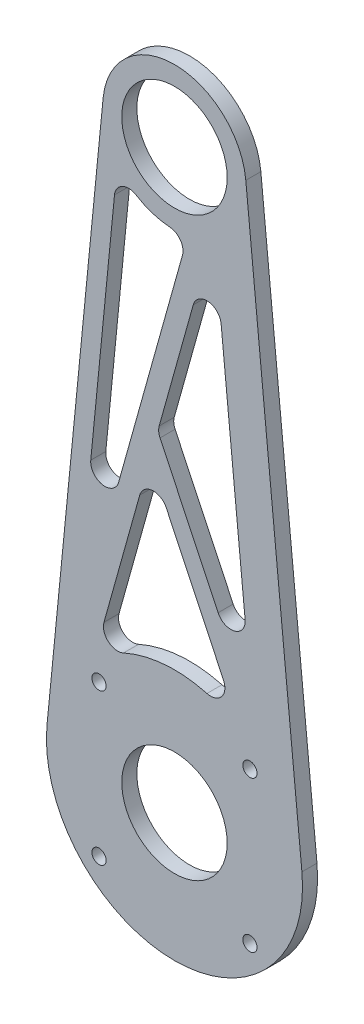
ISO-10303-21;
HEADER;
FILE_DESCRIPTION(('STEP AP214'),'2;1');
FILE_NAME('part.step','',(''),(''),'','','');
FILE_SCHEMA(('AUTOMOTIVE_DESIGN { 1 0 10303 214 1 1 1 1 }'));
ENDSEC;
DATA;
#1=APPLICATION_CONTEXT('core data for automotive mechanical design processes');
#2=APPLICATION_PROTOCOL_DEFINITION('international standard','automotive_design',2000,#1);
#3=PRODUCT_CONTEXT('',#1,'mechanical');
#4=PRODUCT('Part','Part','',(#3));
#5=PRODUCT_RELATED_PRODUCT_CATEGORY('part','',(#4));
#6=PRODUCT_DEFINITION_FORMATION('','',#4);
#7=PRODUCT_DEFINITION_CONTEXT('part definition',#1,'design');
#8=PRODUCT_DEFINITION('design','',#6,#7);
#9=PRODUCT_DEFINITION_SHAPE('','',#8);
#10=(LENGTH_UNIT() NAMED_UNIT(*) SI_UNIT(.MILLI.,.METRE.));
#11=(NAMED_UNIT(*) PLANE_ANGLE_UNIT() SI_UNIT($,.RADIAN.));
#12=(NAMED_UNIT(*) SI_UNIT($,.STERADIAN.) SOLID_ANGLE_UNIT());
#13=UNCERTAINTY_MEASURE_WITH_UNIT(LENGTH_MEASURE(1.E-05),#10,'distance_accuracy_value','');
#14=(GEOMETRIC_REPRESENTATION_CONTEXT(3) GLOBAL_UNCERTAINTY_ASSIGNED_CONTEXT((#13)) GLOBAL_UNIT_ASSIGNED_CONTEXT((#10,
#11,#12)) REPRESENTATION_CONTEXT('',''));
#15=CARTESIAN_POINT('',(0.,0.,0.));
#16=DIRECTION('',(0.,0.,1.));
#17=DIRECTION('',(1.,0.,0.));
#18=AXIS2_PLACEMENT_3D('',#15,#16,#17);
#19=CARTESIAN_POINT('',(0.,0.,3.175));
#20=DIRECTION('',(0.,0.,1.));
#21=DIRECTION('',(1.,0.,0.));
#22=AXIS2_PLACEMENT_3D('',#19,#20,#21);
#23=PLANE('',#22);
#24=DIRECTION('',(-0.428735457416867,0.903430078951078,0.));
#25=VECTOR('',#24,1.);
#26=CARTESIAN_POINT('',(-2.53849015341007,65.8517048939663,3.175));
#27=LINE('',#26,#25);
#28=CARTESIAN_POINT('',(9.1986159595942,41.1193098496756,3.175));
#29=VERTEX_POINT('',#28);
#30=CARTESIAN_POINT('',(-3.04408525005505,66.9170933757851,3.175));
#31=VERTEX_POINT('',#30);
#32=EDGE_CURVE('E425',#29,#31,#27,.T.);
#33=ORIENTED_EDGE('',*,*,#32,.T.);
#34=CARTESIAN_POINT('',(-0.333795013201807,68.2032997480357,3.175));
#35=DIRECTION('',(0.,0.,1.));
#36=DIRECTION('',(1.,0.,0.));
#37=AXIS2_PLACEMENT_3D('',#34,#35,#36);
#38=CIRCLE('',#37,3.);
#39=CARTESIAN_POINT('',(-3.22312817275436,69.0106125084391,3.175));
#40=VERTEX_POINT('',#39);
#41=EDGE_CURVE('E355',#31,#40,#38,.F.);
#42=ORIENTED_EDGE('',*,*,#41,.T.);
#43=DIRECTION('',(0.269104253467781,0.963111053184184,0.));
#44=VECTOR('',#43,1.);
#45=CARTESIAN_POINT('',(-3.52495645481792,67.930383746266,3.175));
#46=LINE('',#45,#44);
#47=CARTESIAN_POINT('',(3.95768063214824,94.7103784604181,3.175));
#48=VERTEX_POINT('',#47);
#49=EDGE_CURVE('E617',#40,#48,#46,.T.);
#50=ORIENTED_EDGE('',*,*,#49,.T.);
#51=CARTESIAN_POINT('',(6.84701379170079,93.9030657000147,3.175));
#52=DIRECTION('',(0.,0.,1.));
#53=DIRECTION('',(1.,0.,0.));
#54=AXIS2_PLACEMENT_3D('',#51,#52,#53);
#55=CIRCLE('',#54,3.);
#56=CARTESIAN_POINT('',(9.83262544841795,94.1965329644152,3.175));
#57=VERTEX_POINT('',#56);
#58=EDGE_CURVE('E343',#48,#57,#55,.F.);
#59=ORIENTED_EDGE('',*,*,#58,.T.);
#60=DIRECTION('',(0.0978224214668025,-0.995203885572384,0.));
#61=VECTOR('',#60,1.);
#62=CARTESIAN_POINT('',(8.26636884411464,110.130964304729,3.175));
#63=LINE('',#62,#61);
#64=CARTESIAN_POINT('',(14.8945178531645,42.6989834863266,3.175));
#65=VERTEX_POINT('',#64);
#66=EDGE_CURVE('E602',#57,#65,#63,.T.);
#67=ORIENTED_EDGE('',*,*,#66,.T.);
#68=CARTESIAN_POINT('',(11.9089061964473,42.4055162219262,3.175));
#69=DIRECTION('',(0.,0.,1.));
#70=DIRECTION('',(1.,0.,0.));
#71=AXIS2_PLACEMENT_3D('',#68,#69,#70);
#72=CIRCLE('',#71,3.);
#73=EDGE_CURVE('E349',#65,#29,#72,.F.);
#74=ORIENTED_EDGE('',*,*,#73,.T.);
#75=EDGE_LOOP('',(#33,#42,#50,#59,#67,#74));
#76=FACE_BOUND('',#75,.T.);
#77=CARTESIAN_POINT('',(0.,121.52122,3.175));
#78=DIRECTION('',(0.,0.,1.));
#79=DIRECTION('',(1.,0.,0.));
#80=AXIS2_PLACEMENT_3D('',#77,#78,#79);
#81=CIRCLE('',#80,11.1125);
#82=CARTESIAN_POINT('',(11.1125,121.52122,3.175));
#83=VERTEX_POINT('',#82);
#84=EDGE_CURVE('E229',#83,#83,#81,.T.);
#85=ORIENTED_EDGE('',*,*,#84,.F.);
#86=EDGE_LOOP('',(#85));
#87=FACE_BOUND('',#86,.T.);
#88=CARTESIAN_POINT('',(0.,0.,3.175));
#89=DIRECTION('',(0.,0.,1.));
#90=DIRECTION('',(1.,0.,0.));
#91=AXIS2_PLACEMENT_3D('',#88,#89,#90);
#92=CIRCLE('',#91,27.);
#93=CARTESIAN_POINT('',(-26.8705049104544,2.64120537960366,3.175));
#94=VERTEX_POINT('',#93);
#95=CARTESIAN_POINT('',(26.8705049104544,2.64120537960366,3.175));
#96=VERTEX_POINT('',#95);
#97=EDGE_CURVE('E193',#94,#96,#92,.T.);
#98=ORIENTED_EDGE('',*,*,#97,.T.);
#99=DIRECTION('',(0.0978224214668023,-0.995203885572384,0.));
#100=VECTOR('',#99,1.);
#101=CARTESIAN_POINT('',(26.8705049104544,2.64120537960366,3.175));
#102=LINE('',#101,#100);
#103=CARTESIAN_POINT('',(15.0400187207127,122.999561344417,3.175));
#104=VERTEX_POINT('',#103);
#105=EDGE_CURVE('E197',#104,#96,#102,.T.);
#106=ORIENTED_EDGE('',*,*,#105,.F.);
#107=CARTESIAN_POINT('',(0.,121.52122,3.175));
#108=DIRECTION('',(0.,0.,1.));
#109=DIRECTION('',(1.,0.,0.));
#110=AXIS2_PLACEMENT_3D('',#107,#108,#109);
#111=CIRCLE('',#110,15.1125);
#112=CARTESIAN_POINT('',(-15.0400187207127,122.999561344417,3.175));
#113=VERTEX_POINT('',#112);
#114=EDGE_CURVE('E221',#104,#113,#111,.T.);
#115=ORIENTED_EDGE('',*,*,#114,.T.);
#116=DIRECTION('',(-0.0978224214668023,-0.995203885572384,0.));
#117=VECTOR('',#116,1.);
#118=CARTESIAN_POINT('',(-26.8705049104544,2.64120537960366,3.175));
#119=LINE('',#118,#117);
#120=EDGE_CURVE('E199',#113,#94,#119,.T.);
#121=ORIENTED_EDGE('',*,*,#120,.T.);
#122=EDGE_LOOP('',(#98,#106,#115,#121));
#123=FACE_BOUND('',#122,.T.);
#124=CARTESIAN_POINT('',(-15.9099025766974,15.9099025766964,3.175));
#125=DIRECTION('',(0.,0.,1.));
#126=DIRECTION('',(1.,0.,0.));
#127=AXIS2_PLACEMENT_3D('',#124,#125,#126);
#128=CIRCLE('',#127,1.50000000000096);
#129=CARTESIAN_POINT('',(-14.4099025766964,15.9099025766964,3.175));
#130=VERTEX_POINT('',#129);
#131=EDGE_CURVE('E204',#130,#130,#128,.T.);
#132=ORIENTED_EDGE('',*,*,#131,.F.);
#133=EDGE_LOOP('',(#132));
#134=FACE_BOUND('',#133,.T.);
#135=CARTESIAN_POINT('',(-15.9099025766964,-15.9099025766982,3.175));
#136=DIRECTION('',(0.,0.,1.));
#137=DIRECTION('',(1.,0.,0.));
#138=AXIS2_PLACEMENT_3D('',#135,#136,#137);
#139=CIRCLE('',#138,1.50000000000066);
#140=CARTESIAN_POINT('',(-14.4099025766957,-15.9099025766982,3.175));
#141=VERTEX_POINT('',#140);
#142=EDGE_CURVE('E462',#141,#141,#139,.T.);
#143=ORIENTED_EDGE('',*,*,#142,.F.);
#144=EDGE_LOOP('',(#143));
#145=FACE_BOUND('',#144,.T.);
#146=CARTESIAN_POINT('',(15.9099025766982,-15.9099025766973,3.175));
#147=DIRECTION('',(0.,0.,1.));
#148=DIRECTION('',(1.,0.,0.));
#149=AXIS2_PLACEMENT_3D('',#146,#147,#148);
#150=CIRCLE('',#149,1.49999999999978);
#151=CARTESIAN_POINT('',(17.409902576698,-15.9099025766973,3.175));
#152=VERTEX_POINT('',#151);
#153=EDGE_CURVE('E458',#152,#152,#150,.T.);
#154=ORIENTED_EDGE('',*,*,#153,.F.);
#155=EDGE_LOOP('',(#154));
#156=FACE_BOUND('',#155,.T.);
#157=CARTESIAN_POINT('',(15.9099025766973,15.9099025766974,3.175));
#158=DIRECTION('',(0.,0.,1.));
#159=DIRECTION('',(1.,0.,0.));
#160=AXIS2_PLACEMENT_3D('',#157,#158,#159);
#161=CIRCLE('',#160,1.5);
#162=CARTESIAN_POINT('',(17.4099025766973,15.9099025766974,3.175));
#163=VERTEX_POINT('',#162);
#164=EDGE_CURVE('E454',#163,#163,#161,.T.);
#165=ORIENTED_EDGE('',*,*,#164,.F.);
#166=EDGE_LOOP('',(#165));
#167=FACE_BOUND('',#166,.T.);
#168=CARTESIAN_POINT('',(0.,0.,3.175));
#169=DIRECTION('',(0.,0.,1.));
#170=DIRECTION('',(1.,0.,0.));
#171=AXIS2_PLACEMENT_3D('',#168,#169,#170);
#172=CIRCLE('',#171,11.1125);
#173=CARTESIAN_POINT('',(11.1125,0.,3.175));
#174=VERTEX_POINT('',#173);
#175=EDGE_CURVE('E270',#174,#174,#172,.T.);
#176=ORIENTED_EDGE('',*,*,#175,.F.);
#177=EDGE_LOOP('',(#176));
#178=FACE_BOUND('',#177,.T.);
#179=DIRECTION('',(0.269104253467781,0.963111053184184,0.));
#180=VECTOR('',#179,1.);
#181=CARTESIAN_POINT('',(-16.957069466739,19.8575036535358,3.175));
#182=LINE('',#181,#180);
#183=CARTESIAN_POINT('',(-14.8657438144377,27.3422565906728,3.175));
#184=VERTEX_POINT('',#183);
#185=CARTESIAN_POINT('',(-7.32509745522579,54.3298636727718,3.175));
#186=VERTEX_POINT('',#185);
#187=EDGE_CURVE('E239',#184,#186,#182,.T.);
#188=ORIENTED_EDGE('',*,*,#187,.T.);
#189=CARTESIAN_POINT('',(-4.43576429567324,53.5225509123685,3.175));
#190=DIRECTION('',(0.,0.,1.));
#191=DIRECTION('',(1.,0.,0.));
#192=AXIS2_PLACEMENT_3D('',#189,#190,#191);
#193=CIRCLE('',#192,3.);
#194=CARTESIAN_POINT('',(-1.72547405882001,54.8087572846191,3.175));
#195=VERTEX_POINT('',#194);
#196=EDGE_CURVE('E361',#186,#195,#193,.F.);
#197=ORIENTED_EDGE('',*,*,#196,.T.);
#198=DIRECTION('',(0.428735457416867,-0.903430078951078,0.));
#199=VECTOR('',#198,1.);
#200=CARTESIAN_POINT('',(-5.16574416780649,62.0580842119991,3.175));
#201=LINE('',#200,#199);
#202=CARTESIAN_POINT('',(10.3417913804946,29.3806514912523,3.175));
#203=VERTEX_POINT('',#202);
#204=EDGE_CURVE('E429',#195,#203,#201,.T.);
#205=ORIENTED_EDGE('',*,*,#204,.T.);
#206=CARTESIAN_POINT('',(7.63150114364133,28.0944451190017,3.175));
#207=DIRECTION('',(0.,0.,1.));
#208=DIRECTION('',(1.,0.,0.));
#209=AXIS2_PLACEMENT_3D('',#206,#207,#208);
#210=CIRCLE('',#209,3.);
#211=CARTESIAN_POINT('',(6.84508625550311,25.1993541664211,3.175));
#212=VERTEX_POINT('',#211);
#213=EDGE_CURVE('E367',#203,#212,#210,.F.);
#214=ORIENTED_EDGE('',*,*,#213,.T.);
#215=CARTESIAN_POINT('',(0.,0.,3.175));
#216=DIRECTION('',(0.,0.,1.));
#217=DIRECTION('',(-1.,0.,0.));
#218=AXIS2_PLACEMENT_3D('',#215,#216,#217);
#219=CIRCLE('',#218,26.1125);
#220=CARTESIAN_POINT('',(-10.7422592778253,23.8005571753683,3.175));
#221=VERTEX_POINT('',#220);
#222=EDGE_CURVE('E433',#212,#221,#219,.T.);
#223=ORIENTED_EDGE('',*,*,#222,.T.);
#224=CARTESIAN_POINT('',(-11.9764106548852,26.5349438302694,3.175));
#225=DIRECTION('',(0.,0.,1.));
#226=DIRECTION('',(1.,0.,0.));
#227=AXIS2_PLACEMENT_3D('',#224,#225,#226);
#228=CIRCLE('',#227,3.);
#229=EDGE_CURVE('E373',#221,#184,#228,.F.);
#230=ORIENTED_EDGE('',*,*,#229,.T.);
#231=EDGE_LOOP('',(#188,#197,#205,#214,#223,#230));
#232=FACE_BOUND('',#231,.T.);
#233=DIRECTION('',(0.0978224214668021,0.995203885572384,0.));
#234=VECTOR('',#233,1.);
#235=CARTESIAN_POINT('',(-21.005906622655,21.4147235138115,3.175));
#236=LINE('',#235,#234);
#237=CARTESIAN_POINT('',(-17.6506101431775,55.5500888375636,3.175));
#238=VERTEX_POINT('',#237);
#239=CARTESIAN_POINT('',(-12.6433526523182,106.491805841121,3.175));
#240=VERTEX_POINT('',#239);
#241=EDGE_CURVE('E414',#238,#240,#236,.T.);
#242=ORIENTED_EDGE('',*,*,#241,.T.);
#243=CARTESIAN_POINT('',(-9.65774099560108,106.19833857672,3.175));
#244=DIRECTION('',(0.,0.,1.));
#245=DIRECTION('',(1.,0.,0.));
#246=AXIS2_PLACEMENT_3D('',#243,#244,#245);
#247=CIRCLE('',#246,3.);
#248=CARTESIAN_POINT('',(-8.05811515782036,108.736289951177,3.175));
#249=VERTEX_POINT('',#248);
#250=EDGE_CURVE('E11',#240,#249,#247,.F.);
#251=ORIENTED_EDGE('',*,*,#250,.T.);
#252=CARTESIAN_POINT('',(0.,121.52122,3.175));
#253=DIRECTION('',(0.,0.,1.));
#254=DIRECTION('',(-1.,0.,0.));
#255=AXIS2_PLACEMENT_3D('',#252,#253,#254);
#256=CIRCLE('',#255,15.1125);
#257=CARTESIAN_POINT('',(-1.00094054364259,106.441903892229,3.175));
#258=VERTEX_POINT('',#257);
#259=EDGE_CURVE('E404',#249,#258,#256,.T.);
#260=ORIENTED_EDGE('',*,*,#259,.T.);
#261=CARTESIAN_POINT('',(-1.1996384183111,103.448491265376,3.175));
#262=DIRECTION('',(0.,0.,1.));
#263=DIRECTION('',(1.,0.,0.));
#264=AXIS2_PLACEMENT_3D('',#261,#262,#263);
#265=CIRCLE('',#264,3.);
#266=CARTESIAN_POINT('',(1.68969474124145,102.641178504972,3.175));
#267=VERTEX_POINT('',#266);
#268=EDGE_CURVE('E385',#258,#267,#265,.F.);
#269=ORIENTED_EDGE('',*,*,#268,.T.);
#270=DIRECTION('',(-0.269104253467781,-0.963111053184184,0.));
#271=VECTOR('',#270,1.);
#272=CARTESIAN_POINT('',(-21.005906622655,21.4147235138115,3.175));
#273=LINE('',#272,#271);
#274=CARTESIAN_POINT('',(-11.7756653269078,54.4493088127599,3.175));
#275=VERTEX_POINT('',#274);
#276=EDGE_CURVE('E410',#267,#275,#273,.T.);
#277=ORIENTED_EDGE('',*,*,#276,.T.);
#278=CARTESIAN_POINT('',(-14.6649984864603,55.2566215731632,3.175));
#279=DIRECTION('',(0.,0.,1.));
#280=DIRECTION('',(1.,0.,0.));
#281=AXIS2_PLACEMENT_3D('',#278,#279,#280);
#282=CIRCLE('',#281,3.);
#283=EDGE_CURVE('E379',#275,#238,#282,.F.);
#284=ORIENTED_EDGE('',*,*,#283,.T.);
#285=EDGE_LOOP('',(#242,#251,#260,#269,#277,#284));
#286=FACE_BOUND('',#285,.T.);
#287=ADVANCED_FACE('F43',(#76,#87,#123,#134,#145,#156,#167,#178,#232,#286),#23,.T.);
#288=CARTESIAN_POINT('',(0.,0.,0.));
#289=DIRECTION('',(0.,0.,1.));
#290=DIRECTION('',(1.,0.,0.));
#291=AXIS2_PLACEMENT_3D('',#288,#289,#290);
#292=PLANE('',#291);
#293=CARTESIAN_POINT('',(0.,0.,0.));
#294=DIRECTION('',(0.,0.,1.));
#295=DIRECTION('',(1.,0.,0.));
#296=AXIS2_PLACEMENT_3D('',#293,#294,#295);
#297=CIRCLE('',#296,11.1125);
#298=CARTESIAN_POINT('',(11.1125,0.,0.));
#299=VERTEX_POINT('',#298);
#300=EDGE_CURVE('E234',#299,#299,#297,.T.);
#301=ORIENTED_EDGE('',*,*,#300,.T.);
#302=EDGE_LOOP('',(#301));
#303=FACE_BOUND('',#302,.T.);
#304=CARTESIAN_POINT('',(15.9099025766973,15.9099025766974,0.));
#305=DIRECTION('',(0.,0.,1.));
#306=DIRECTION('',(1.,0.,0.));
#307=AXIS2_PLACEMENT_3D('',#304,#305,#306);
#308=CIRCLE('',#307,1.5);
#309=CARTESIAN_POINT('',(17.4099025766973,15.9099025766974,0.));
#310=VERTEX_POINT('',#309);
#311=EDGE_CURVE('E238',#310,#310,#308,.T.);
#312=ORIENTED_EDGE('',*,*,#311,.T.);
#313=EDGE_LOOP('',(#312));
#314=FACE_BOUND('',#313,.T.);
#315=CARTESIAN_POINT('',(15.9099025766982,-15.9099025766973,0.));
#316=DIRECTION('',(0.,0.,1.));
#317=DIRECTION('',(1.,0.,0.));
#318=AXIS2_PLACEMENT_3D('',#315,#316,#317);
#319=CIRCLE('',#318,1.49999999999978);
#320=CARTESIAN_POINT('',(17.409902576698,-15.9099025766973,0.));
#321=VERTEX_POINT('',#320);
#322=EDGE_CURVE('E243',#321,#321,#319,.T.);
#323=ORIENTED_EDGE('',*,*,#322,.T.);
#324=EDGE_LOOP('',(#323));
#325=FACE_BOUND('',#324,.T.);
#326=CARTESIAN_POINT('',(-15.9099025766964,-15.9099025766982,0.));
#327=DIRECTION('',(0.,0.,1.));
#328=DIRECTION('',(1.,0.,0.));
#329=AXIS2_PLACEMENT_3D('',#326,#327,#328);
#330=CIRCLE('',#329,1.50000000000066);
#331=CARTESIAN_POINT('',(-14.4099025766957,-15.9099025766982,0.));
#332=VERTEX_POINT('',#331);
#333=EDGE_CURVE('E247',#332,#332,#330,.T.);
#334=ORIENTED_EDGE('',*,*,#333,.T.);
#335=EDGE_LOOP('',(#334));
#336=FACE_BOUND('',#335,.T.);
#337=CARTESIAN_POINT('',(-15.9099025766974,15.9099025766964,0.));
#338=DIRECTION('',(0.,0.,1.));
#339=DIRECTION('',(1.,0.,0.));
#340=AXIS2_PLACEMENT_3D('',#337,#338,#339);
#341=CIRCLE('',#340,1.50000000000096);
#342=CARTESIAN_POINT('',(-14.4099025766964,15.9099025766964,0.));
#343=VERTEX_POINT('',#342);
#344=EDGE_CURVE('E251',#343,#343,#341,.T.);
#345=ORIENTED_EDGE('',*,*,#344,.T.);
#346=EDGE_LOOP('',(#345));
#347=FACE_BOUND('',#346,.T.);
#348=CARTESIAN_POINT('',(0.,0.,0.));
#349=DIRECTION('',(0.,0.,1.));
#350=DIRECTION('',(1.,0.,0.));
#351=AXIS2_PLACEMENT_3D('',#348,#349,#350);
#352=CIRCLE('',#351,27.);
#353=CARTESIAN_POINT('',(-26.8705049104544,2.64120537960366,0.));
#354=VERTEX_POINT('',#353);
#355=CARTESIAN_POINT('',(26.8705049104544,2.64120537960366,0.));
#356=VERTEX_POINT('',#355);
#357=EDGE_CURVE('E210',#354,#356,#352,.T.);
#358=ORIENTED_EDGE('',*,*,#357,.F.);
#359=DIRECTION('',(-0.0978224214668023,-0.995203885572384,0.));
#360=VECTOR('',#359,1.);
#361=CARTESIAN_POINT('',(-26.8705049104544,2.64120537960366,0.));
#362=LINE('',#361,#360);
#363=CARTESIAN_POINT('',(-15.0400187207127,122.999561344417,0.));
#364=VERTEX_POINT('',#363);
#365=EDGE_CURVE('E263',#364,#354,#362,.T.);
#366=ORIENTED_EDGE('',*,*,#365,.F.);
#367=CARTESIAN_POINT('',(0.,121.52122,0.));
#368=DIRECTION('',(0.,0.,1.));
#369=DIRECTION('',(1.,0.,0.));
#370=AXIS2_PLACEMENT_3D('',#367,#368,#369);
#371=CIRCLE('',#370,15.1125);
#372=CARTESIAN_POINT('',(15.0400187207127,122.999561344417,0.));
#373=VERTEX_POINT('',#372);
#374=EDGE_CURVE('E260',#373,#364,#371,.T.);
#375=ORIENTED_EDGE('',*,*,#374,.F.);
#376=DIRECTION('',(0.0978224214668023,-0.995203885572384,0.));
#377=VECTOR('',#376,1.);
#378=CARTESIAN_POINT('',(26.8705049104544,2.64120537960366,0.));
#379=LINE('',#378,#377);
#380=EDGE_CURVE('E257',#373,#356,#379,.T.);
#381=ORIENTED_EDGE('',*,*,#380,.T.);
#382=EDGE_LOOP('',(#358,#366,#375,#381));
#383=FACE_BOUND('',#382,.T.);
#384=CARTESIAN_POINT('',(0.,121.52122,0.));
#385=DIRECTION('',(0.,0.,1.));
#386=DIRECTION('',(1.,0.,0.));
#387=AXIS2_PLACEMENT_3D('',#384,#385,#386);
#388=CIRCLE('',#387,11.1125);
#389=CARTESIAN_POINT('',(11.1125,121.52122,0.));
#390=VERTEX_POINT('',#389);
#391=EDGE_CURVE('E266',#390,#390,#388,.T.);
#392=ORIENTED_EDGE('',*,*,#391,.T.);
#393=EDGE_LOOP('',(#392));
#394=FACE_BOUND('',#393,.T.);
#395=CARTESIAN_POINT('',(0.,0.,0.));
#396=DIRECTION('',(0.,0.,1.));
#397=DIRECTION('',(-1.,0.,0.));
#398=AXIS2_PLACEMENT_3D('',#395,#396,#397);
#399=CIRCLE('',#398,26.1125);
#400=CARTESIAN_POINT('',(6.84508625550311,25.1993541664211,0.));
#401=VERTEX_POINT('',#400);
#402=CARTESIAN_POINT('',(-10.7422592778253,23.8005571753683,0.));
#403=VERTEX_POINT('',#402);
#404=EDGE_CURVE('E444',#401,#403,#399,.T.);
#405=ORIENTED_EDGE('',*,*,#404,.F.);
#406=CARTESIAN_POINT('',(7.63150114364133,28.0944451190017,0.));
#407=DIRECTION('',(0.,0.,1.));
#408=DIRECTION('',(1.,0.,0.));
#409=AXIS2_PLACEMENT_3D('',#406,#407,#408);
#410=CIRCLE('',#409,3.);
#411=CARTESIAN_POINT('',(10.3417913804946,29.3806514912523,0.));
#412=VERTEX_POINT('',#411);
#413=EDGE_CURVE('E364',#401,#412,#410,.T.);
#414=ORIENTED_EDGE('',*,*,#413,.T.);
#415=DIRECTION('',(0.428735457416867,-0.903430078951078,0.));
#416=VECTOR('',#415,1.);
#417=CARTESIAN_POINT('',(-5.16574416780649,62.0580842119991,0.));
#418=LINE('',#417,#416);
#419=CARTESIAN_POINT('',(-1.72547405882001,54.8087572846191,0.));
#420=VERTEX_POINT('',#419);
#421=EDGE_CURVE('E422',#420,#412,#418,.T.);
#422=ORIENTED_EDGE('',*,*,#421,.F.);
#423=CARTESIAN_POINT('',(-4.43576429567324,53.5225509123685,0.));
#424=DIRECTION('',(0.,0.,1.));
#425=DIRECTION('',(1.,0.,0.));
#426=AXIS2_PLACEMENT_3D('',#423,#424,#425);
#427=CIRCLE('',#426,3.);
#428=CARTESIAN_POINT('',(-7.32509745522579,54.3298636727718,0.));
#429=VERTEX_POINT('',#428);
#430=EDGE_CURVE('E358',#420,#429,#427,.T.);
#431=ORIENTED_EDGE('',*,*,#430,.T.);
#432=DIRECTION('',(0.269104253467781,0.963111053184184,0.));
#433=VECTOR('',#432,1.);
#434=CARTESIAN_POINT('',(-16.957069466739,19.8575036535358,0.));
#435=LINE('',#434,#433);
#436=CARTESIAN_POINT('',(-14.8657438144377,27.3422565906728,0.));
#437=VERTEX_POINT('',#436);
#438=EDGE_CURVE('E434',#437,#429,#435,.T.);
#439=ORIENTED_EDGE('',*,*,#438,.F.);
#440=CARTESIAN_POINT('',(-11.9764106548852,26.5349438302694,0.));
#441=DIRECTION('',(0.,0.,1.));
#442=DIRECTION('',(1.,0.,0.));
#443=AXIS2_PLACEMENT_3D('',#440,#441,#442);
#444=CIRCLE('',#443,3.);
#445=EDGE_CURVE('E370',#437,#403,#444,.T.);
#446=ORIENTED_EDGE('',*,*,#445,.T.);
#447=EDGE_LOOP('',(#405,#414,#422,#431,#439,#446));
#448=FACE_BOUND('',#447,.T.);
#449=DIRECTION('',(0.0978224214668025,-0.995203885572384,0.));
#450=VECTOR('',#449,1.);
#451=CARTESIAN_POINT('',(8.26636884411464,110.130964304729,0.));
#452=LINE('',#451,#450);
#453=CARTESIAN_POINT('',(9.83262544841795,94.1965329644152,0.));
#454=VERTEX_POINT('',#453);
#455=CARTESIAN_POINT('',(14.8945178531645,42.6989834863266,0.));
#456=VERTEX_POINT('',#455);
#457=EDGE_CURVE('E609',#454,#456,#452,.T.);
#458=ORIENTED_EDGE('',*,*,#457,.F.);
#459=CARTESIAN_POINT('',(6.84701379170079,93.9030657000147,0.));
#460=DIRECTION('',(0.,0.,1.));
#461=DIRECTION('',(1.,0.,0.));
#462=AXIS2_PLACEMENT_3D('',#459,#460,#461);
#463=CIRCLE('',#462,3.);
#464=CARTESIAN_POINT('',(3.95768063214824,94.7103784604181,0.));
#465=VERTEX_POINT('',#464);
#466=EDGE_CURVE('E340',#454,#465,#463,.T.);
#467=ORIENTED_EDGE('',*,*,#466,.T.);
#468=DIRECTION('',(0.269104253467781,0.963111053184184,0.));
#469=VECTOR('',#468,1.);
#470=CARTESIAN_POINT('',(-3.52495645481792,67.930383746266,0.));
#471=LINE('',#470,#469);
#472=CARTESIAN_POINT('',(-3.22312817275436,69.0106125084391,0.));
#473=VERTEX_POINT('',#472);
#474=EDGE_CURVE('E614',#473,#465,#471,.T.);
#475=ORIENTED_EDGE('',*,*,#474,.F.);
#476=CARTESIAN_POINT('',(-0.333795013201807,68.2032997480357,0.));
#477=DIRECTION('',(0.,0.,1.));
#478=DIRECTION('',(1.,0.,0.));
#479=AXIS2_PLACEMENT_3D('',#476,#477,#478);
#480=CIRCLE('',#479,3.);
#481=CARTESIAN_POINT('',(-3.04408525005504,66.9170933757851,0.));
#482=VERTEX_POINT('',#481);
#483=EDGE_CURVE('E352',#473,#482,#480,.T.);
#484=ORIENTED_EDGE('',*,*,#483,.T.);
#485=DIRECTION('',(-0.428735457416863,0.903430078951079,0.));
#486=VECTOR('',#485,1.);
#487=CARTESIAN_POINT('',(-2.53849015341007,65.8517048939663,0.));
#488=LINE('',#487,#486);
#489=CARTESIAN_POINT('',(9.19861595959409,41.1193098496756,0.));
#490=VERTEX_POINT('',#489);
#491=EDGE_CURVE('E417',#490,#482,#488,.T.);
#492=ORIENTED_EDGE('',*,*,#491,.F.);
#493=CARTESIAN_POINT('',(11.9089061964473,42.4055162219262,0.));
#494=DIRECTION('',(0.,0.,1.));
#495=DIRECTION('',(1.,0.,0.));
#496=AXIS2_PLACEMENT_3D('',#493,#494,#495);
#497=CIRCLE('',#496,3.);
#498=EDGE_CURVE('E346',#490,#456,#497,.T.);
#499=ORIENTED_EDGE('',*,*,#498,.T.);
#500=EDGE_LOOP('',(#458,#467,#475,#484,#492,#499));
#501=FACE_BOUND('',#500,.T.);
#502=DIRECTION('',(-0.269104253467781,-0.963111053184184,0.));
#503=VECTOR('',#502,1.);
#504=CARTESIAN_POINT('',(-21.005906622655,21.4147235138115,0.));
#505=LINE('',#504,#503);
#506=CARTESIAN_POINT('',(1.68969474124145,102.641178504972,0.));
#507=VERTEX_POINT('',#506);
#508=CARTESIAN_POINT('',(-11.7756653269078,54.4493088127599,0.));
#509=VERTEX_POINT('',#508);
#510=EDGE_CURVE('E405',#507,#509,#505,.T.);
#511=ORIENTED_EDGE('',*,*,#510,.F.);
#512=CARTESIAN_POINT('',(-1.1996384183111,103.448491265376,0.));
#513=DIRECTION('',(0.,0.,1.));
#514=DIRECTION('',(1.,0.,0.));
#515=AXIS2_PLACEMENT_3D('',#512,#513,#514);
#516=CIRCLE('',#515,3.);
#517=CARTESIAN_POINT('',(-1.00094054364259,106.441903892229,0.));
#518=VERTEX_POINT('',#517);
#519=EDGE_CURVE('E382',#507,#518,#516,.T.);
#520=ORIENTED_EDGE('',*,*,#519,.T.);
#521=CARTESIAN_POINT('',(0.,121.52122,0.));
#522=DIRECTION('',(0.,0.,1.));
#523=DIRECTION('',(-1.,0.,0.));
#524=AXIS2_PLACEMENT_3D('',#521,#522,#523);
#525=CIRCLE('',#524,15.1125);
#526=CARTESIAN_POINT('',(-8.05811515782036,108.736289951177,0.));
#527=VERTEX_POINT('',#526);
#528=EDGE_CURVE('E395',#527,#518,#525,.T.);
#529=ORIENTED_EDGE('',*,*,#528,.F.);
#530=CARTESIAN_POINT('',(-9.65774099560108,106.19833857672,0.));
#531=DIRECTION('',(0.,0.,1.));
#532=DIRECTION('',(1.,0.,0.));
#533=AXIS2_PLACEMENT_3D('',#530,#531,#532);
#534=CIRCLE('',#533,3.);
#535=CARTESIAN_POINT('',(-12.6433526523182,106.491805841121,0.));
#536=VERTEX_POINT('',#535);
#537=EDGE_CURVE('E52',#527,#536,#534,.T.);
#538=ORIENTED_EDGE('',*,*,#537,.T.);
#539=DIRECTION('',(0.0978224214668021,0.995203885572384,0.));
#540=VECTOR('',#539,1.);
#541=CARTESIAN_POINT('',(-21.005906622655,21.4147235138115,0.));
#542=LINE('',#541,#540);
#543=CARTESIAN_POINT('',(-17.6506101431775,55.5500888375636,0.));
#544=VERTEX_POINT('',#543);
#545=EDGE_CURVE('E394',#544,#536,#542,.T.);
#546=ORIENTED_EDGE('',*,*,#545,.F.);
#547=CARTESIAN_POINT('',(-14.6649984864603,55.2566215731632,0.));
#548=DIRECTION('',(0.,0.,1.));
#549=DIRECTION('',(1.,0.,0.));
#550=AXIS2_PLACEMENT_3D('',#547,#548,#549);
#551=CIRCLE('',#550,3.);
#552=EDGE_CURVE('E376',#544,#509,#551,.T.);
#553=ORIENTED_EDGE('',*,*,#552,.T.);
#554=EDGE_LOOP('',(#511,#520,#529,#538,#546,#553));
#555=FACE_BOUND('',#554,.T.);
#556=ADVANCED_FACE('F393',(#303,#314,#325,#336,#347,#383,#394,#448,#501,#555),#292,.F.);
#557=CARTESIAN_POINT('',(0.,0.,3.175));
#558=DIRECTION('',(0.,0.,-1.));
#559=DIRECTION('',(-1.,0.,0.));
#560=AXIS2_PLACEMENT_3D('',#557,#558,#559);
#561=CYLINDRICAL_SURFACE('',#560,27.);
#562=ORIENTED_EDGE('',*,*,#357,.T.);
#563=DIRECTION('',(0.,0.,-1.));
#564=VECTOR('',#563,1.);
#565=CARTESIAN_POINT('',(26.8705049104544,2.64120537960366,3.175));
#566=LINE('',#565,#564);
#567=EDGE_CURVE('E207',#96,#356,#566,.T.);
#568=ORIENTED_EDGE('',*,*,#567,.F.);
#569=ORIENTED_EDGE('',*,*,#97,.F.);
#570=DIRECTION('',(0.,0.,-1.));
#571=VECTOR('',#570,1.);
#572=CARTESIAN_POINT('',(-26.8705049104544,2.64120537960366,3.175));
#573=LINE('',#572,#571);
#574=EDGE_CURVE('E233',#94,#354,#573,.T.);
#575=ORIENTED_EDGE('',*,*,#574,.T.);
#576=EDGE_LOOP('',(#562,#568,#569,#575));
#577=FACE_BOUND('',#576,.T.);
#578=ADVANCED_FACE('F208',(#577),#561,.T.);
#579=CARTESIAN_POINT('',(26.8705049104544,2.64120537960366,3.175));
#580=DIRECTION('',(0.995203885572384,0.0978224214668022,0.));
#581=DIRECTION('',(-0.0978224214668023,0.995203885572384,0.));
#582=AXIS2_PLACEMENT_3D('',#579,#580,#581);
#583=PLANE('',#582);
#584=ORIENTED_EDGE('',*,*,#380,.F.);
#585=DIRECTION('',(0.,0.,-1.));
#586=VECTOR('',#585,1.);
#587=CARTESIAN_POINT('',(15.0400187207127,122.999561344417,3.175));
#588=LINE('',#587,#586);
#589=EDGE_CURVE('E216',#104,#373,#588,.T.);
#590=ORIENTED_EDGE('',*,*,#589,.F.);
#591=ORIENTED_EDGE('',*,*,#105,.T.);
#592=ORIENTED_EDGE('',*,*,#567,.T.);
#593=EDGE_LOOP('',(#584,#590,#591,#592));
#594=FACE_BOUND('',#593,.T.);
#595=ADVANCED_FACE('F218',(#594),#583,.T.);
#596=CARTESIAN_POINT('',(0.,121.52122,3.175));
#597=DIRECTION('',(0.,0.,-1.));
#598=DIRECTION('',(-1.,0.,0.));
#599=AXIS2_PLACEMENT_3D('',#596,#597,#598);
#600=CYLINDRICAL_SURFACE('',#599,15.1125);
#601=ORIENTED_EDGE('',*,*,#374,.T.);
#602=DIRECTION('',(0.,0.,-1.));
#603=VECTOR('',#602,1.);
#604=CARTESIAN_POINT('',(-15.0400187207127,122.999561344417,3.175));
#605=LINE('',#604,#603);
#606=EDGE_CURVE('E273',#113,#364,#605,.T.);
#607=ORIENTED_EDGE('',*,*,#606,.F.);
#608=ORIENTED_EDGE('',*,*,#114,.F.);
#609=ORIENTED_EDGE('',*,*,#589,.T.);
#610=EDGE_LOOP('',(#601,#607,#608,#609));
#611=FACE_BOUND('',#610,.T.);
#612=ADVANCED_FACE('F550',(#611),#600,.T.);
#613=CARTESIAN_POINT('',(-26.8705049104544,2.64120537960366,3.175));
#614=DIRECTION('',(0.995203885572384,-0.0978224214668022,0.));
#615=DIRECTION('',(0.0978224214668023,0.995203885572384,0.));
#616=AXIS2_PLACEMENT_3D('',#613,#614,#615);
#617=PLANE('',#616);
#618=ORIENTED_EDGE('',*,*,#365,.T.);
#619=ORIENTED_EDGE('',*,*,#574,.F.);
#620=ORIENTED_EDGE('',*,*,#120,.F.);
#621=ORIENTED_EDGE('',*,*,#606,.T.);
#622=EDGE_LOOP('',(#618,#619,#620,#621));
#623=FACE_BOUND('',#622,.T.);
#624=ADVANCED_FACE('F545',(#623),#617,.F.);
#625=CARTESIAN_POINT('',(-15.9099025766974,15.9099025766964,3.175));
#626=DIRECTION('',(0.,0.,-1.));
#627=DIRECTION('',(-1.,0.,0.));
#628=AXIS2_PLACEMENT_3D('',#625,#626,#627);
#629=CYLINDRICAL_SURFACE('',#628,1.50000000000096);
#630=ORIENTED_EDGE('',*,*,#131,.T.);
#631=EDGE_LOOP('',(#630));
#632=FACE_BOUND('',#631,.T.);
#633=ORIENTED_EDGE('',*,*,#344,.F.);
#634=EDGE_LOOP('',(#633));
#635=FACE_BOUND('',#634,.T.);
#636=ADVANCED_FACE('F469',(#632,#635),#629,.F.);
#637=CARTESIAN_POINT('',(-15.9099025766964,-15.9099025766982,3.175));
#638=DIRECTION('',(0.,0.,-1.));
#639=DIRECTION('',(-1.,0.,0.));
#640=AXIS2_PLACEMENT_3D('',#637,#638,#639);
#641=CYLINDRICAL_SURFACE('',#640,1.50000000000066);
#642=ORIENTED_EDGE('',*,*,#142,.T.);
#643=EDGE_LOOP('',(#642));
#644=FACE_BOUND('',#643,.T.);
#645=ORIENTED_EDGE('',*,*,#333,.F.);
#646=EDGE_LOOP('',(#645));
#647=FACE_BOUND('',#646,.T.);
#648=ADVANCED_FACE('F538',(#644,#647),#641,.F.);
#649=CARTESIAN_POINT('',(15.9099025766982,-15.9099025766973,3.175));
#650=DIRECTION('',(0.,0.,-1.));
#651=DIRECTION('',(-1.,0.,0.));
#652=AXIS2_PLACEMENT_3D('',#649,#650,#651);
#653=CYLINDRICAL_SURFACE('',#652,1.49999999999978);
#654=ORIENTED_EDGE('',*,*,#153,.T.);
#655=EDGE_LOOP('',(#654));
#656=FACE_BOUND('',#655,.T.);
#657=ORIENTED_EDGE('',*,*,#322,.F.);
#658=EDGE_LOOP('',(#657));
#659=FACE_BOUND('',#658,.T.);
#660=ADVANCED_FACE('F534',(#656,#659),#653,.F.);
#661=CARTESIAN_POINT('',(15.9099025766973,15.9099025766974,3.175));
#662=DIRECTION('',(0.,0.,-1.));
#663=DIRECTION('',(-1.,0.,0.));
#664=AXIS2_PLACEMENT_3D('',#661,#662,#663);
#665=CYLINDRICAL_SURFACE('',#664,1.5);
#666=ORIENTED_EDGE('',*,*,#164,.T.);
#667=EDGE_LOOP('',(#666));
#668=FACE_BOUND('',#667,.T.);
#669=ORIENTED_EDGE('',*,*,#311,.F.);
#670=EDGE_LOOP('',(#669));
#671=FACE_BOUND('',#670,.T.);
#672=ADVANCED_FACE('F530',(#668,#671),#665,.F.);
#673=CARTESIAN_POINT('',(0.,0.,3.175));
#674=DIRECTION('',(0.,0.,-1.));
#675=DIRECTION('',(-1.,0.,0.));
#676=AXIS2_PLACEMENT_3D('',#673,#674,#675);
#677=CYLINDRICAL_SURFACE('',#676,11.1125);
#678=ORIENTED_EDGE('',*,*,#175,.T.);
#679=EDGE_LOOP('',(#678));
#680=FACE_BOUND('',#679,.T.);
#681=ORIENTED_EDGE('',*,*,#300,.F.);
#682=EDGE_LOOP('',(#681));
#683=FACE_BOUND('',#682,.T.);
#684=ADVANCED_FACE('F526',(#680,#683),#677,.F.);
#685=CARTESIAN_POINT('',(0.,121.52122,3.175));
#686=DIRECTION('',(0.,0.,-1.));
#687=DIRECTION('',(-1.,0.,0.));
#688=AXIS2_PLACEMENT_3D('',#685,#686,#687);
#689=CYLINDRICAL_SURFACE('',#688,11.1125);
#690=ORIENTED_EDGE('',*,*,#84,.T.);
#691=EDGE_LOOP('',(#690));
#692=FACE_BOUND('',#691,.T.);
#693=ORIENTED_EDGE('',*,*,#391,.F.);
#694=EDGE_LOOP('',(#693));
#695=FACE_BOUND('',#694,.T.);
#696=ADVANCED_FACE('F529',(#692,#695),#689,.F.);
#697=CARTESIAN_POINT('',(-5.16574416780649,62.0580842119991,3.175));
#698=DIRECTION('',(0.903430078951077,0.428735457416867,0.));
#699=DIRECTION('',(-0.428735457416867,0.903430078951078,0.));
#700=AXIS2_PLACEMENT_3D('',#697,#698,#699);
#701=PLANE('',#700);
#702=ORIENTED_EDGE('',*,*,#204,.F.);
#703=DIRECTION('',(0.,0.,-1.));
#704=VECTOR('',#703,1.);
#705=CARTESIAN_POINT('',(-1.72547405882001,54.8087572846191,0.));
#706=LINE('',#705,#704);
#707=EDGE_CURVE('E302',#195,#420,#706,.T.);
#708=ORIENTED_EDGE('',*,*,#707,.T.);
#709=ORIENTED_EDGE('',*,*,#421,.T.);
#710=DIRECTION('',(0.,0.,1.));
#711=VECTOR('',#710,1.);
#712=CARTESIAN_POINT('',(10.3417913804946,29.3806514912523,3.175));
#713=LINE('',#712,#711);
#714=EDGE_CURVE('E299',#412,#203,#713,.T.);
#715=ORIENTED_EDGE('',*,*,#714,.T.);
#716=EDGE_LOOP('',(#702,#708,#709,#715));
#717=FACE_BOUND('',#716,.T.);
#718=ADVANCED_FACE('F559',(#717),#701,.F.);
#719=CARTESIAN_POINT('',(-16.957069466739,19.8575036535358,3.175));
#720=DIRECTION('',(-0.963111053184184,0.269104253467781,0.));
#721=DIRECTION('',(-0.269104253467781,-0.963111053184184,0.));
#722=AXIS2_PLACEMENT_3D('',#719,#720,#721);
#723=PLANE('',#722);
#724=ORIENTED_EDGE('',*,*,#438,.T.);
#725=DIRECTION('',(0.,0.,-1.));
#726=VECTOR('',#725,1.);
#727=CARTESIAN_POINT('',(-7.3250974552258,54.3298636727718,3.175));
#728=LINE('',#727,#726);
#729=EDGE_CURVE('E310',#429,#186,#728,.F.);
#730=ORIENTED_EDGE('',*,*,#729,.T.);
#731=ORIENTED_EDGE('',*,*,#187,.F.);
#732=DIRECTION('',(0.,0.,1.));
#733=VECTOR('',#732,1.);
#734=CARTESIAN_POINT('',(-14.8657438144377,27.3422565906728,0.));
#735=LINE('',#734,#733);
#736=EDGE_CURVE('E306',#184,#437,#735,.F.);
#737=ORIENTED_EDGE('',*,*,#736,.T.);
#738=EDGE_LOOP('',(#724,#730,#731,#737));
#739=FACE_BOUND('',#738,.T.);
#740=ADVANCED_FACE('F566',(#739),#723,.F.);
#741=CARTESIAN_POINT('',(0.,0.,3.175));
#742=DIRECTION('',(0.,0.,-1.));
#743=DIRECTION('',(-1.,0.,0.));
#744=AXIS2_PLACEMENT_3D('',#741,#742,#743);
#745=CYLINDRICAL_SURFACE('',#744,26.1125);
#746=ORIENTED_EDGE('',*,*,#222,.F.);
#747=DIRECTION('',(0.,0.,-1.));
#748=VECTOR('',#747,1.);
#749=CARTESIAN_POINT('',(6.84508625550311,25.1993541664211,3.175));
#750=LINE('',#749,#748);
#751=EDGE_CURVE('E316',#212,#401,#750,.T.);
#752=ORIENTED_EDGE('',*,*,#751,.T.);
#753=ORIENTED_EDGE('',*,*,#404,.T.);
#754=DIRECTION('',(0.,0.,-1.));
#755=VECTOR('',#754,1.);
#756=CARTESIAN_POINT('',(-10.7422592778253,23.8005571753683,3.175));
#757=LINE('',#756,#755);
#758=EDGE_CURVE('E313',#403,#221,#757,.F.);
#759=ORIENTED_EDGE('',*,*,#758,.T.);
#760=EDGE_LOOP('',(#746,#752,#753,#759));
#761=FACE_BOUND('',#760,.T.);
#762=ADVANCED_FACE('F568',(#761),#745,.T.);
#763=CARTESIAN_POINT('',(-3.52495645481792,67.930383746266,3.175));
#764=DIRECTION('',(-0.963111053184184,0.269104253467781,0.));
#765=DIRECTION('',(-0.269104253467781,-0.963111053184184,0.));
#766=AXIS2_PLACEMENT_3D('',#763,#764,#765);
#767=PLANE('',#766);
#768=ORIENTED_EDGE('',*,*,#474,.T.);
#769=DIRECTION('',(0.,0.,-1.));
#770=VECTOR('',#769,1.);
#771=CARTESIAN_POINT('',(3.95768063214824,94.7103784604181,3.175));
#772=LINE('',#771,#770);
#773=EDGE_CURVE('E289',#465,#48,#772,.F.);
#774=ORIENTED_EDGE('',*,*,#773,.T.);
#775=ORIENTED_EDGE('',*,*,#49,.F.);
#776=DIRECTION('',(0.,0.,-1.));
#777=VECTOR('',#776,1.);
#778=CARTESIAN_POINT('',(-3.22312817275436,69.0106125084391,0.));
#779=LINE('',#778,#777);
#780=EDGE_CURVE('E285',#40,#473,#779,.T.);
#781=ORIENTED_EDGE('',*,*,#780,.T.);
#782=EDGE_LOOP('',(#768,#774,#775,#781));
#783=FACE_BOUND('',#782,.T.);
#784=ADVANCED_FACE('F571',(#783),#767,.F.);
#785=CARTESIAN_POINT('',(-2.53849015341007,65.8517048939663,3.175));
#786=DIRECTION('',(-0.903430078951079,-0.428735457416863,0.));
#787=DIRECTION('',(0.428735457416863,-0.903430078951079,0.));
#788=AXIS2_PLACEMENT_3D('',#785,#786,#787);
#789=PLANE('',#788);
#790=ORIENTED_EDGE('',*,*,#32,.F.);
#791=DIRECTION('',(0.,0.,-1.));
#792=VECTOR('',#791,1.);
#793=CARTESIAN_POINT('',(9.19861595959409,41.1193098496756,0.));
#794=LINE('',#793,#792);
#795=EDGE_CURVE('E295',#29,#490,#794,.T.);
#796=ORIENTED_EDGE('',*,*,#795,.T.);
#797=ORIENTED_EDGE('',*,*,#491,.T.);
#798=DIRECTION('',(0.,0.,-1.));
#799=VECTOR('',#798,1.);
#800=CARTESIAN_POINT('',(-3.04408525005504,66.9170933757851,3.175));
#801=LINE('',#800,#799);
#802=EDGE_CURVE('E292',#482,#31,#801,.F.);
#803=ORIENTED_EDGE('',*,*,#802,.T.);
#804=EDGE_LOOP('',(#790,#796,#797,#803));
#805=FACE_BOUND('',#804,.T.);
#806=ADVANCED_FACE('F585',(#805),#789,.F.);
#807=CARTESIAN_POINT('',(8.26636884411464,110.130964304729,3.175));
#808=DIRECTION('',(0.995203885572384,0.0978224214668025,0.));
#809=DIRECTION('',(-0.0978224214668025,0.995203885572384,0.));
#810=AXIS2_PLACEMENT_3D('',#807,#808,#809);
#811=PLANE('',#810);
#812=ORIENTED_EDGE('',*,*,#66,.F.);
#813=DIRECTION('',(0.,0.,-1.));
#814=VECTOR('',#813,1.);
#815=CARTESIAN_POINT('',(9.83262544841795,94.1965329644152,0.));
#816=LINE('',#815,#814);
#817=EDGE_CURVE('E281',#57,#454,#816,.T.);
#818=ORIENTED_EDGE('',*,*,#817,.T.);
#819=ORIENTED_EDGE('',*,*,#457,.T.);
#820=DIRECTION('',(0.,0.,-1.));
#821=VECTOR('',#820,1.);
#822=CARTESIAN_POINT('',(14.8945178531645,42.6989834863266,3.175));
#823=LINE('',#822,#821);
#824=EDGE_CURVE('E215',#456,#65,#823,.F.);
#825=ORIENTED_EDGE('',*,*,#824,.T.);
#826=EDGE_LOOP('',(#812,#818,#819,#825));
#827=FACE_BOUND('',#826,.T.);
#828=ADVANCED_FACE('F578',(#827),#811,.F.);
#829=CARTESIAN_POINT('',(0.,121.52122,3.175));
#830=DIRECTION('',(0.,0.,-1.));
#831=DIRECTION('',(-1.,0.,0.));
#832=AXIS2_PLACEMENT_3D('',#829,#830,#831);
#833=CYLINDRICAL_SURFACE('',#832,15.1125);
#834=ORIENTED_EDGE('',*,*,#528,.T.);
#835=DIRECTION('',(0.,0.,-1.));
#836=VECTOR('',#835,1.);
#837=CARTESIAN_POINT('',(-1.00094054364259,106.441903892229,3.175));
#838=LINE('',#837,#836);
#839=EDGE_CURVE('E59',#518,#258,#838,.F.);
#840=ORIENTED_EDGE('',*,*,#839,.T.);
#841=ORIENTED_EDGE('',*,*,#259,.F.);
#842=DIRECTION('',(0.,0.,-1.));
#843=VECTOR('',#842,1.);
#844=CARTESIAN_POINT('',(-8.05811515782036,108.736289951177,3.175));
#845=LINE('',#844,#843);
#846=EDGE_CURVE('E334',#249,#527,#845,.T.);
#847=ORIENTED_EDGE('',*,*,#846,.T.);
#848=EDGE_LOOP('',(#834,#840,#841,#847));
#849=FACE_BOUND('',#848,.T.);
#850=ADVANCED_FACE('F407',(#849),#833,.T.);
#851=CARTESIAN_POINT('',(-21.005906622655,21.4147235138115,3.175));
#852=DIRECTION('',(-0.995203885572384,0.0978224214668021,0.));
#853=DIRECTION('',(-0.0978224214668021,-0.995203885572384,0.));
#854=AXIS2_PLACEMENT_3D('',#851,#852,#853);
#855=PLANE('',#854);
#856=ORIENTED_EDGE('',*,*,#241,.F.);
#857=DIRECTION('',(0.,0.,-1.));
#858=VECTOR('',#857,1.);
#859=CARTESIAN_POINT('',(-17.6506101431775,55.5500888375636,0.));
#860=LINE('',#859,#858);
#861=EDGE_CURVE('E323',#238,#544,#860,.T.);
#862=ORIENTED_EDGE('',*,*,#861,.T.);
#863=ORIENTED_EDGE('',*,*,#545,.T.);
#864=DIRECTION('',(0.,0.,1.));
#865=VECTOR('',#864,1.);
#866=CARTESIAN_POINT('',(-12.6433526523182,106.491805841121,3.175));
#867=LINE('',#866,#865);
#868=EDGE_CURVE('E320',#536,#240,#867,.T.);
#869=ORIENTED_EDGE('',*,*,#868,.T.);
#870=EDGE_LOOP('',(#856,#862,#863,#869));
#871=FACE_BOUND('',#870,.T.);
#872=ADVANCED_FACE('F401',(#871),#855,.F.);
#873=CARTESIAN_POINT('',(-21.005906622655,21.4147235138115,3.175));
#874=DIRECTION('',(0.963111053184184,-0.269104253467781,0.));
#875=DIRECTION('',(0.269104253467781,0.963111053184184,0.));
#876=AXIS2_PLACEMENT_3D('',#873,#874,#875);
#877=PLANE('',#876);
#878=ORIENTED_EDGE('',*,*,#510,.T.);
#879=DIRECTION('',(0.,0.,-1.));
#880=VECTOR('',#879,1.);
#881=CARTESIAN_POINT('',(-11.7756653269078,54.4493088127599,3.175));
#882=LINE('',#881,#880);
#883=EDGE_CURVE('E331',#509,#275,#882,.F.);
#884=ORIENTED_EDGE('',*,*,#883,.T.);
#885=ORIENTED_EDGE('',*,*,#276,.F.);
#886=DIRECTION('',(0.,0.,1.));
#887=VECTOR('',#886,1.);
#888=CARTESIAN_POINT('',(1.68969474124146,102.641178504972,0.));
#889=LINE('',#888,#887);
#890=EDGE_CURVE('E327',#267,#507,#889,.F.);
#891=ORIENTED_EDGE('',*,*,#890,.T.);
#892=EDGE_LOOP('',(#878,#884,#885,#891));
#893=FACE_BOUND('',#892,.T.);
#894=ADVANCED_FACE('F490',(#893),#877,.F.);
#895=CARTESIAN_POINT('',(6.84701379170079,93.9030657000147,3.175));
#896=DIRECTION('',(0.,0.,1.));
#897=DIRECTION('',(1.,0.,0.));
#898=AXIS2_PLACEMENT_3D('',#895,#896,#897);
#899=CYLINDRICAL_SURFACE('',#898,3.);
#900=ORIENTED_EDGE('',*,*,#58,.F.);
#901=ORIENTED_EDGE('',*,*,#773,.F.);
#902=ORIENTED_EDGE('',*,*,#466,.F.);
#903=ORIENTED_EDGE('',*,*,#817,.F.);
#904=EDGE_LOOP('',(#900,#901,#902,#903));
#905=FACE_BOUND('',#904,.T.);
#906=ADVANCED_FACE('F521',(#905),#899,.F.);
#907=CARTESIAN_POINT('',(11.9089061964473,42.4055162219262,3.175));
#908=DIRECTION('',(0.,0.,1.));
#909=DIRECTION('',(1.,0.,0.));
#910=AXIS2_PLACEMENT_3D('',#907,#908,#909);
#911=CYLINDRICAL_SURFACE('',#910,3.);
#912=ORIENTED_EDGE('',*,*,#73,.F.);
#913=ORIENTED_EDGE('',*,*,#824,.F.);
#914=ORIENTED_EDGE('',*,*,#498,.F.);
#915=ORIENTED_EDGE('',*,*,#795,.F.);
#916=EDGE_LOOP('',(#912,#913,#914,#915));
#917=FACE_BOUND('',#916,.T.);
#918=ADVANCED_FACE('F517',(#917),#911,.F.);
#919=CARTESIAN_POINT('',(-0.333795013201807,68.2032997480357,3.175));
#920=DIRECTION('',(0.,0.,1.));
#921=DIRECTION('',(1.,0.,0.));
#922=AXIS2_PLACEMENT_3D('',#919,#920,#921);
#923=CYLINDRICAL_SURFACE('',#922,3.);
#924=ORIENTED_EDGE('',*,*,#41,.F.);
#925=ORIENTED_EDGE('',*,*,#802,.F.);
#926=ORIENTED_EDGE('',*,*,#483,.F.);
#927=ORIENTED_EDGE('',*,*,#780,.F.);
#928=EDGE_LOOP('',(#924,#925,#926,#927));
#929=FACE_BOUND('',#928,.T.);
#930=ADVANCED_FACE('F513',(#929),#923,.F.);
#931=CARTESIAN_POINT('',(-4.43576429567324,53.5225509123685,3.175));
#932=DIRECTION('',(0.,0.,1.));
#933=DIRECTION('',(1.,0.,0.));
#934=AXIS2_PLACEMENT_3D('',#931,#932,#933);
#935=CYLINDRICAL_SURFACE('',#934,3.);
#936=ORIENTED_EDGE('',*,*,#196,.F.);
#937=ORIENTED_EDGE('',*,*,#729,.F.);
#938=ORIENTED_EDGE('',*,*,#430,.F.);
#939=ORIENTED_EDGE('',*,*,#707,.F.);
#940=EDGE_LOOP('',(#936,#937,#938,#939));
#941=FACE_BOUND('',#940,.T.);
#942=ADVANCED_FACE('F509',(#941),#935,.F.);
#943=CARTESIAN_POINT('',(7.63150114364133,28.0944451190017,3.175));
#944=DIRECTION('',(0.,0.,-1.));
#945=DIRECTION('',(-1.,0.,0.));
#946=AXIS2_PLACEMENT_3D('',#943,#944,#945);
#947=CYLINDRICAL_SURFACE('',#946,3.);
#948=ORIENTED_EDGE('',*,*,#213,.F.);
#949=ORIENTED_EDGE('',*,*,#714,.F.);
#950=ORIENTED_EDGE('',*,*,#413,.F.);
#951=ORIENTED_EDGE('',*,*,#751,.F.);
#952=EDGE_LOOP('',(#948,#949,#950,#951));
#953=FACE_BOUND('',#952,.T.);
#954=ADVANCED_FACE('F505',(#953),#947,.F.);
#955=CARTESIAN_POINT('',(-11.9764106548852,26.5349438302694,3.175));
#956=DIRECTION('',(0.,0.,-1.));
#957=DIRECTION('',(-1.,0.,0.));
#958=AXIS2_PLACEMENT_3D('',#955,#956,#957);
#959=CYLINDRICAL_SURFACE('',#958,3.);
#960=ORIENTED_EDGE('',*,*,#229,.F.);
#961=ORIENTED_EDGE('',*,*,#758,.F.);
#962=ORIENTED_EDGE('',*,*,#445,.F.);
#963=ORIENTED_EDGE('',*,*,#736,.F.);
#964=EDGE_LOOP('',(#960,#961,#962,#963));
#965=FACE_BOUND('',#964,.T.);
#966=ADVANCED_FACE('F500',(#965),#959,.F.);
#967=CARTESIAN_POINT('',(-14.6649984864603,55.2566215731632,3.175));
#968=DIRECTION('',(0.,0.,1.));
#969=DIRECTION('',(1.,0.,0.));
#970=AXIS2_PLACEMENT_3D('',#967,#968,#969);
#971=CYLINDRICAL_SURFACE('',#970,3.);
#972=ORIENTED_EDGE('',*,*,#283,.F.);
#973=ORIENTED_EDGE('',*,*,#883,.F.);
#974=ORIENTED_EDGE('',*,*,#552,.F.);
#975=ORIENTED_EDGE('',*,*,#861,.F.);
#976=EDGE_LOOP('',(#972,#973,#974,#975));
#977=FACE_BOUND('',#976,.T.);
#978=ADVANCED_FACE('F487',(#977),#971,.F.);
#979=CARTESIAN_POINT('',(-1.1996384183111,103.448491265376,3.175));
#980=DIRECTION('',(0.,0.,-1.));
#981=DIRECTION('',(-1.,0.,0.));
#982=AXIS2_PLACEMENT_3D('',#979,#980,#981);
#983=CYLINDRICAL_SURFACE('',#982,3.);
#984=ORIENTED_EDGE('',*,*,#268,.F.);
#985=ORIENTED_EDGE('',*,*,#839,.F.);
#986=ORIENTED_EDGE('',*,*,#519,.F.);
#987=ORIENTED_EDGE('',*,*,#890,.F.);
#988=EDGE_LOOP('',(#984,#985,#986,#987));
#989=FACE_BOUND('',#988,.T.);
#990=ADVANCED_FACE('F494',(#989),#983,.F.);
#991=CARTESIAN_POINT('',(-9.65774099560108,106.19833857672,3.175));
#992=DIRECTION('',(0.,0.,-1.));
#993=DIRECTION('',(-1.,0.,0.));
#994=AXIS2_PLACEMENT_3D('',#991,#992,#993);
#995=CYLINDRICAL_SURFACE('',#994,3.);
#996=ORIENTED_EDGE('',*,*,#250,.F.);
#997=ORIENTED_EDGE('',*,*,#868,.F.);
#998=ORIENTED_EDGE('',*,*,#537,.F.);
#999=ORIENTED_EDGE('',*,*,#846,.F.);
#1000=EDGE_LOOP('',(#996,#997,#998,#999));
#1001=FACE_BOUND('',#1000,.T.);
#1002=ADVANCED_FACE('F45',(#1001),#995,.F.);
#1003=CLOSED_SHELL('',(#287,#556,#578,#595,#612,#624,#636,#648,#660,#672,#684,#696,#718,#740,
#762,#784,#806,#828,#850,#872,#894,#906,#918,#930,#942,#954,#966,#978,#990,#1002));
#1004=MANIFOLD_SOLID_BREP('B2',#1003);
#1005=ADVANCED_BREP_SHAPE_REPRESENTATION('',(#18,#1004),#14);
#1006=SHAPE_DEFINITION_REPRESENTATION(#9,#1005);
ENDSEC;
END-ISO-10303-21;
